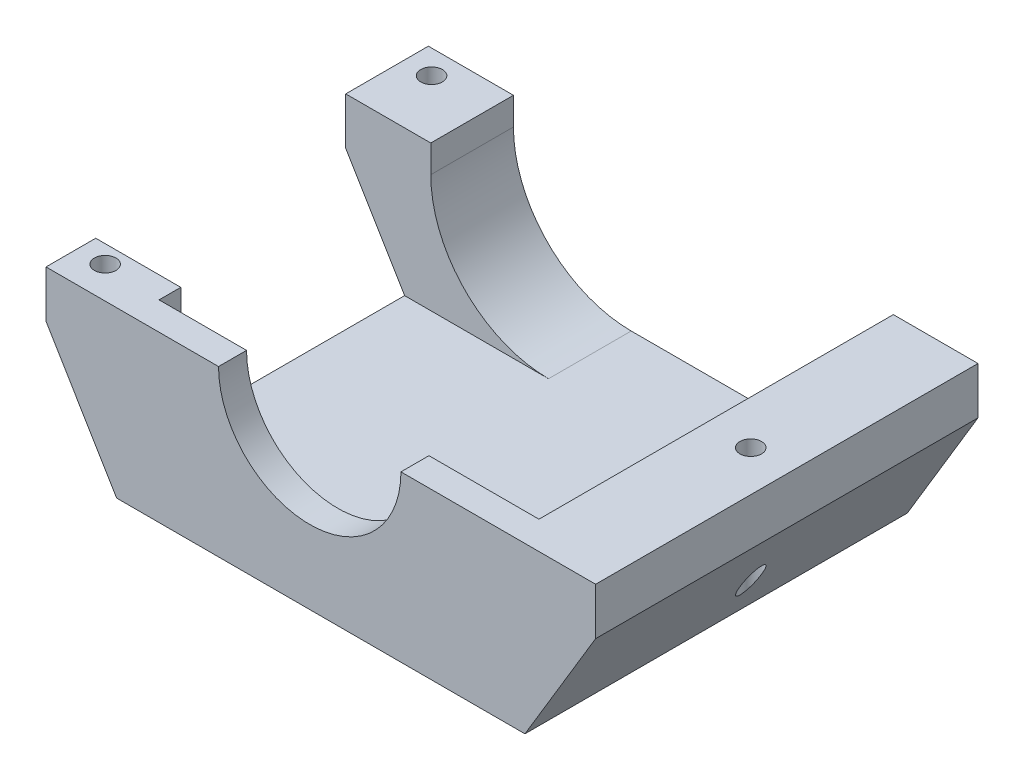
ISO-10303-21;
HEADER;
FILE_DESCRIPTION(('STEP AP214'),'2;1');
FILE_NAME('part.step','',(''),(''),'','','');
FILE_SCHEMA(('AUTOMOTIVE_DESIGN { 1 0 10303 214 1 1 1 1 }'));
ENDSEC;
DATA;
#1=APPLICATION_CONTEXT('core data for automotive mechanical design processes');
#2=APPLICATION_PROTOCOL_DEFINITION('international standard','automotive_design',2000,#1);
#3=PRODUCT_CONTEXT('',#1,'mechanical');
#4=PRODUCT('Part','Part','',(#3));
#5=PRODUCT_RELATED_PRODUCT_CATEGORY('part','',(#4));
#6=PRODUCT_DEFINITION_FORMATION('','',#4);
#7=PRODUCT_DEFINITION_CONTEXT('part definition',#1,'design');
#8=PRODUCT_DEFINITION('design','',#6,#7);
#9=PRODUCT_DEFINITION_SHAPE('','',#8);
#10=(LENGTH_UNIT() NAMED_UNIT(*) SI_UNIT(.MILLI.,.METRE.));
#11=(NAMED_UNIT(*) PLANE_ANGLE_UNIT() SI_UNIT($,.RADIAN.));
#12=(NAMED_UNIT(*) SI_UNIT($,.STERADIAN.) SOLID_ANGLE_UNIT());
#13=UNCERTAINTY_MEASURE_WITH_UNIT(LENGTH_MEASURE(1.E-05),#10,'distance_accuracy_value','');
#14=(GEOMETRIC_REPRESENTATION_CONTEXT(3) GLOBAL_UNCERTAINTY_ASSIGNED_CONTEXT((#13)) GLOBAL_UNIT_ASSIGNED_CONTEXT((#10,
#11,#12)) REPRESENTATION_CONTEXT('',''));
#15=CARTESIAN_POINT('',(0.,0.,0.));
#16=DIRECTION('',(0.,0.,1.));
#17=DIRECTION('',(1.,0.,0.));
#18=AXIS2_PLACEMENT_3D('',#15,#16,#17);
#19=CARTESIAN_POINT('',(88.4243474547859,33.,-97.3933423163109));
#20=DIRECTION('',(0.,0.,1.));
#21=DIRECTION('',(1.,0.,0.));
#22=AXIS2_PLACEMENT_3D('',#19,#20,#21);
#23=CYLINDRICAL_SURFACE('',#22,30.);
#24=DIRECTION('',(0.,0.,1.));
#25=VECTOR('',#24,1.);
#26=CARTESIAN_POINT('',(118.424347454786,33.,-97.3933423163109));
#27=LINE('',#26,#25);
#28=CARTESIAN_POINT('',(118.424347454786,33.,-97.3933423163109));
#29=VERTEX_POINT('',#28);
#30=CARTESIAN_POINT('',(118.424347454786,33.,-7.13392697639392));
#31=VERTEX_POINT('',#30);
#32=EDGE_CURVE('E266',#29,#31,#27,.T.);
#33=ORIENTED_EDGE('',*,*,#32,.F.);
#34=CARTESIAN_POINT('',(88.4243474547859,33.,-97.3933423163109));
#35=DIRECTION('',(0.,0.,-1.));
#36=DIRECTION('',(-1.,0.,0.));
#37=AXIS2_PLACEMENT_3D('',#34,#35,#36);
#38=CIRCLE('',#37,30.);
#39=CARTESIAN_POINT('',(88.4243474547859,3.,-97.3933423163109));
#40=VERTEX_POINT('',#39);
#41=EDGE_CURVE('E11',#29,#40,#38,.T.);
#42=ORIENTED_EDGE('',*,*,#41,.T.);
#43=DIRECTION('',(0.,0.,1.));
#44=VECTOR('',#43,1.);
#45=CARTESIAN_POINT('',(88.4243474547859,3.,0.));
#46=LINE('',#45,#44);
#47=CARTESIAN_POINT('',(88.4243474547859,3.,-7.13392697639392));
#48=VERTEX_POINT('',#47);
#49=EDGE_CURVE('E269',#48,#40,#46,.F.);
#50=ORIENTED_EDGE('',*,*,#49,.F.);
#51=CARTESIAN_POINT('',(88.4243474547859,33.,-7.13392697639392));
#52=DIRECTION('',(0.,0.,1.));
#53=DIRECTION('',(1.,0.,0.));
#54=AXIS2_PLACEMENT_3D('',#51,#52,#53);
#55=CIRCLE('',#54,30.);
#56=EDGE_CURVE('E41',#31,#48,#55,.F.);
#57=ORIENTED_EDGE('',*,*,#56,.F.);
#58=EDGE_LOOP('',(#33,#42,#50,#57));
#59=FACE_BOUND('',#58,.T.);
#60=ADVANCED_FACE('F34',(#59),#23,.F.);
#61=CARTESIAN_POINT('',(51.6644031130144,33.,-97.3933423163109));
#62=DIRECTION('',(0.,0.,-1.));
#63=DIRECTION('',(-1.,0.,0.));
#64=AXIS2_PLACEMENT_3D('',#61,#62,#63);
#65=CYLINDRICAL_SURFACE('',#64,30.);
#66=DIRECTION('',(0.,0.,-1.));
#67=VECTOR('',#66,1.);
#68=CARTESIAN_POINT('',(21.6644031130144,33.,-97.3933423163109));
#69=LINE('',#68,#67);
#70=CARTESIAN_POINT('',(21.6644031130144,33.,-76.3394750395605));
#71=VERTEX_POINT('',#70);
#72=CARTESIAN_POINT('',(21.6644031130144,33.,-97.3933423163109));
#73=VERTEX_POINT('',#72);
#74=EDGE_CURVE('E247',#71,#73,#69,.T.);
#75=ORIENTED_EDGE('',*,*,#74,.F.);
#76=CARTESIAN_POINT('',(51.6644031130144,33.,-76.3394750395605));
#77=DIRECTION('',(0.,0.,-1.));
#78=DIRECTION('',(-1.,0.,0.));
#79=AXIS2_PLACEMENT_3D('',#76,#77,#78);
#80=CIRCLE('',#79,30.);
#81=CARTESIAN_POINT('',(51.6644031130144,3.,-76.3394750395605));
#82=VERTEX_POINT('',#81);
#83=EDGE_CURVE('E167',#71,#82,#80,.F.);
#84=ORIENTED_EDGE('',*,*,#83,.T.);
#85=DIRECTION('',(0.,0.,-1.));
#86=VECTOR('',#85,1.);
#87=CARTESIAN_POINT('',(51.6644031130144,3.,0.));
#88=LINE('',#87,#86);
#89=CARTESIAN_POINT('',(51.6644031130144,3.,-97.3933423163109));
#90=VERTEX_POINT('',#89);
#91=EDGE_CURVE('E260',#90,#82,#88,.F.);
#92=ORIENTED_EDGE('',*,*,#91,.F.);
#93=CARTESIAN_POINT('',(51.6644031130144,33.,-97.3933423163109));
#94=DIRECTION('',(0.,0.,-1.));
#95=DIRECTION('',(-1.,0.,0.));
#96=AXIS2_PLACEMENT_3D('',#93,#94,#95);
#97=CIRCLE('',#96,30.);
#98=EDGE_CURVE('E264',#90,#73,#97,.T.);
#99=ORIENTED_EDGE('',*,*,#98,.T.);
#100=EDGE_LOOP('',(#75,#84,#92,#99));
#101=FACE_BOUND('',#100,.T.);
#102=ADVANCED_FACE('F347',(#101),#65,.F.);
#103=CARTESIAN_POINT('',(0.,-2.,0.));
#104=DIRECTION('',(-1.,0.,0.));
#105=DIRECTION('',(0.,0.,1.));
#106=AXIS2_PLACEMENT_3D('',#103,#104,#105);
#107=PLANE('',#106);
#108=DIRECTION('',(0.,-1.,0.));
#109=VECTOR('',#108,1.);
#110=CARTESIAN_POINT('',(0.,-2.,-76.3394750395605));
#111=LINE('',#110,#109);
#112=CARTESIAN_POINT('',(0.,40.,-76.3394750395605));
#113=VERTEX_POINT('',#112);
#114=CARTESIAN_POINT('',(0.,28.,-76.3394750395605));
#115=VERTEX_POINT('',#114);
#116=EDGE_CURVE('E315',#113,#115,#111,.T.);
#117=ORIENTED_EDGE('',*,*,#116,.F.);
#118=DIRECTION('',(0.,0.,1.));
#119=VECTOR('',#118,1.);
#120=CARTESIAN_POINT('',(0.,40.,0.));
#121=LINE('',#120,#119);
#122=CARTESIAN_POINT('',(0.,40.,-97.3933423163109));
#123=VERTEX_POINT('',#122);
#124=EDGE_CURVE('E183',#123,#113,#121,.T.);
#125=ORIENTED_EDGE('',*,*,#124,.F.);
#126=DIRECTION('',(0.,1.,0.));
#127=VECTOR('',#126,1.);
#128=CARTESIAN_POINT('',(0.,-2.,-97.3933423163109));
#129=LINE('',#128,#127);
#130=CARTESIAN_POINT('',(0.,28.,-97.3933423163109));
#131=VERTEX_POINT('',#130);
#132=EDGE_CURVE('E232',#131,#123,#129,.T.);
#133=ORIENTED_EDGE('',*,*,#132,.F.);
#134=DIRECTION('',(0.,0.,-1.));
#135=VECTOR('',#134,1.);
#136=CARTESIAN_POINT('',(0.,28.,-97.3933423163109));
#137=LINE('',#136,#135);
#138=EDGE_CURVE('E300',#115,#131,#137,.T.);
#139=ORIENTED_EDGE('',*,*,#138,.F.);
#140=EDGE_LOOP('',(#117,#125,#133,#139));
#141=FACE_BOUND('',#140,.T.);
#142=ADVANCED_FACE('F336',(#141),#107,.T.);
#143=CARTESIAN_POINT('',(0.,40.,0.));
#144=DIRECTION('',(0.,-1.,0.));
#145=DIRECTION('',(0.,0.,-1.));
#146=AXIS2_PLACEMENT_3D('',#143,#144,#145);
#147=PLANE('',#146);
#148=CARTESIAN_POINT('',(6.93445288931982,40.,-91.2755933321376));
#149=DIRECTION('',(0.,1.,0.));
#150=DIRECTION('',(0.,0.,1.));
#151=AXIS2_PLACEMENT_3D('',#148,#149,#150);
#152=CIRCLE('',#151,2.75);
#153=CARTESIAN_POINT('',(6.93445288931982,40.,-88.5255933321376));
#154=VERTEX_POINT('',#153);
#155=EDGE_CURVE('E258',#154,#154,#152,.T.);
#156=ORIENTED_EDGE('',*,*,#155,.F.);
#157=EDGE_LOOP('',(#156));
#158=FACE_BOUND('',#157,.T.);
#159=ORIENTED_EDGE('',*,*,#124,.T.);
#160=DIRECTION('',(1.,0.,0.));
#161=VECTOR('',#160,1.);
#162=CARTESIAN_POINT('',(-8.33559688698558,40.,-76.3394750395605));
#163=LINE('',#162,#161);
#164=CARTESIAN_POINT('',(21.6644031130144,40.,-76.3394750395605));
#165=VERTEX_POINT('',#164);
#166=EDGE_CURVE('E164',#113,#165,#163,.T.);
#167=ORIENTED_EDGE('',*,*,#166,.T.);
#168=DIRECTION('',(0.,0.,1.));
#169=VECTOR('',#168,1.);
#170=CARTESIAN_POINT('',(21.6644031130144,40.,-97.3933423163109));
#171=LINE('',#170,#169);
#172=CARTESIAN_POINT('',(21.6644031130144,40.,-97.3933423163109));
#173=VERTEX_POINT('',#172);
#174=EDGE_CURVE('E180',#173,#165,#171,.T.);
#175=ORIENTED_EDGE('',*,*,#174,.F.);
#176=DIRECTION('',(-1.,0.,0.));
#177=VECTOR('',#176,1.);
#178=CARTESIAN_POINT('',(0.,40.,-97.3933423163109));
#179=LINE('',#178,#177);
#180=EDGE_CURVE('E222',#173,#123,#179,.T.);
#181=ORIENTED_EDGE('',*,*,#180,.T.);
#182=EDGE_LOOP('',(#159,#167,#175,#181));
#183=FACE_BOUND('',#182,.T.);
#184=ADVANCED_FACE('F178',(#158,#183),#147,.F.);
#185=CARTESIAN_POINT('',(21.6644031130144,3.,-97.3933423163109));
#186=DIRECTION('',(-1.,0.,0.));
#187=DIRECTION('',(0.,0.,1.));
#188=AXIS2_PLACEMENT_3D('',#185,#186,#187);
#189=PLANE('',#188);
#190=DIRECTION('',(0.,1.,0.));
#191=VECTOR('',#190,1.);
#192=CARTESIAN_POINT('',(21.6644031130144,3.,-76.3394750395605));
#193=LINE('',#192,#191);
#194=EDGE_CURVE('E161',#71,#165,#193,.T.);
#195=ORIENTED_EDGE('',*,*,#194,.F.);
#196=ORIENTED_EDGE('',*,*,#74,.T.);
#197=DIRECTION('',(0.,1.,0.));
#198=VECTOR('',#197,1.);
#199=CARTESIAN_POINT('',(21.6644031130144,3.,-97.3933423163109));
#200=LINE('',#199,#198);
#201=EDGE_CURVE('E188',#73,#173,#200,.T.);
#202=ORIENTED_EDGE('',*,*,#201,.T.);
#203=ORIENTED_EDGE('',*,*,#174,.T.);
#204=EDGE_LOOP('',(#195,#196,#202,#203));
#205=FACE_BOUND('',#204,.T.);
#206=ADVANCED_FACE('F186',(#205),#189,.F.);
#207=CARTESIAN_POINT('',(129.624485254823,40.,-49.8785981742458));
#208=DIRECTION('',(0.,1.,0.));
#209=DIRECTION('',(0.,0.,1.));
#210=AXIS2_PLACEMENT_3D('',#207,#208,#209);
#211=CIRCLE('',#210,2.75000000000001);
#212=CARTESIAN_POINT('',(129.624485254823,40.,-47.1285981742458));
#213=VERTEX_POINT('',#212);
#214=EDGE_CURVE('E250',#213,#213,#211,.T.);
#215=ORIENTED_EDGE('',*,*,#214,.F.);
#216=EDGE_LOOP('',(#215));
#217=FACE_BOUND('',#216,.T.);
#218=DIRECTION('',(1.,0.,0.));
#219=VECTOR('',#218,1.);
#220=CARTESIAN_POINT('',(21.6644031130144,40.,-7.13392697639392));
#221=LINE('',#220,#219);
#222=CARTESIAN_POINT('',(90.4058082347499,40.,-7.13392697639392));
#223=VERTEX_POINT('',#222);
#224=CARTESIAN_POINT('',(118.424347454786,40.,-7.13392697639392));
#225=VERTEX_POINT('',#224);
#226=EDGE_CURVE('E189',#223,#225,#221,.T.);
#227=ORIENTED_EDGE('',*,*,#226,.F.);
#228=DIRECTION('',(0.,0.,1.));
#229=VECTOR('',#228,1.);
#230=CARTESIAN_POINT('',(90.4058082347499,40.,-72.83989263353));
#231=LINE('',#230,#229);
#232=CARTESIAN_POINT('',(90.4058082347499,40.,0.));
#233=VERTEX_POINT('',#232);
#234=EDGE_CURVE('E195',#223,#233,#231,.T.);
#235=ORIENTED_EDGE('',*,*,#234,.T.);
#236=DIRECTION('',(1.,0.,0.));
#237=VECTOR('',#236,1.);
#238=CARTESIAN_POINT('',(0.,40.,0.));
#239=LINE('',#238,#237);
#240=CARTESIAN_POINT('',(139.991389113124,40.,0.));
#241=VERTEX_POINT('',#240);
#242=EDGE_CURVE('E215',#233,#241,#239,.T.);
#243=ORIENTED_EDGE('',*,*,#242,.T.);
#244=DIRECTION('',(0.,0.,-1.));
#245=VECTOR('',#244,1.);
#246=CARTESIAN_POINT('',(139.991389113124,40.,0.));
#247=LINE('',#246,#245);
#248=CARTESIAN_POINT('',(139.991389113124,40.,-97.3933423163109));
#249=VERTEX_POINT('',#248);
#250=EDGE_CURVE('E219',#241,#249,#247,.T.);
#251=ORIENTED_EDGE('',*,*,#250,.T.);
#252=CARTESIAN_POINT('',(118.424347454786,40.,-97.3933423163109));
#253=VERTEX_POINT('',#252);
#254=EDGE_CURVE('E223',#249,#253,#179,.T.);
#255=ORIENTED_EDGE('',*,*,#254,.T.);
#256=DIRECTION('',(0.,0.,-1.));
#257=VECTOR('',#256,1.);
#258=CARTESIAN_POINT('',(118.424347454786,40.,-97.3933423163109));
#259=LINE('',#258,#257);
#260=EDGE_CURVE('E201',#225,#253,#259,.T.);
#261=ORIENTED_EDGE('',*,*,#260,.F.);
#262=EDGE_LOOP('',(#227,#235,#243,#251,#255,#261));
#263=FACE_BOUND('',#262,.T.);
#264=ADVANCED_FACE('F338',(#217,#263),#147,.F.);
#265=DIRECTION('',(0.,1.,0.));
#266=VECTOR('',#265,1.);
#267=CARTESIAN_POINT('',(0.,-2.,-12.6665994272912));
#268=LINE('',#267,#266);
#269=CARTESIAN_POINT('',(0.,28.,-12.6665994272912));
#270=VERTEX_POINT('',#269);
#271=CARTESIAN_POINT('',(0.,40.,-12.6665994272912));
#272=VERTEX_POINT('',#271);
#273=EDGE_CURVE('E317',#270,#272,#268,.T.);
#274=ORIENTED_EDGE('',*,*,#273,.F.);
#275=CARTESIAN_POINT('',(0.,28.,0.));
#276=VERTEX_POINT('',#275);
#277=EDGE_CURVE('E294',#276,#270,#137,.T.);
#278=ORIENTED_EDGE('',*,*,#277,.F.);
#279=DIRECTION('',(0.,1.,0.));
#280=VECTOR('',#279,1.);
#281=CARTESIAN_POINT('',(0.,-2.,0.));
#282=LINE('',#281,#280);
#283=CARTESIAN_POINT('',(0.,40.,0.));
#284=VERTEX_POINT('',#283);
#285=EDGE_CURVE('E231',#276,#284,#282,.T.);
#286=ORIENTED_EDGE('',*,*,#285,.T.);
#287=EDGE_CURVE('E206',#272,#284,#121,.T.);
#288=ORIENTED_EDGE('',*,*,#287,.F.);
#289=EDGE_LOOP('',(#274,#278,#286,#288));
#290=FACE_BOUND('',#289,.T.);
#291=ADVANCED_FACE('F350',(#290),#107,.T.);
#292=CARTESIAN_POINT('',(0.,-2.,-97.3933423163109));
#293=DIRECTION('',(0.,0.,-1.));
#294=DIRECTION('',(-1.,0.,0.));
#295=AXIS2_PLACEMENT_3D('',#292,#293,#294);
#296=PLANE('',#295);
#297=ORIENTED_EDGE('',*,*,#41,.F.);
#298=DIRECTION('',(0.,1.,0.));
#299=VECTOR('',#298,1.);
#300=CARTESIAN_POINT('',(118.424347454786,3.,-97.3933423163109));
#301=LINE('',#300,#299);
#302=EDGE_CURVE('E207',#29,#253,#301,.T.);
#303=ORIENTED_EDGE('',*,*,#302,.T.);
#304=ORIENTED_EDGE('',*,*,#254,.F.);
#305=DIRECTION('',(0.,1.,0.));
#306=VECTOR('',#305,1.);
#307=CARTESIAN_POINT('',(139.991389113124,-2.,-97.3933423163109));
#308=LINE('',#307,#306);
#309=CARTESIAN_POINT('',(139.991389113124,28.,-97.3933423163109));
#310=VERTEX_POINT('',#309);
#311=EDGE_CURVE('E235',#310,#249,#308,.T.);
#312=ORIENTED_EDGE('',*,*,#311,.F.);
#313=DIRECTION('',(0.514495755427527,0.857492925712544,0.));
#314=VECTOR('',#313,1.);
#315=CARTESIAN_POINT('',(121.991389113124,-2.,-97.3933423163109));
#316=LINE('',#315,#314);
#317=CARTESIAN_POINT('',(121.991389113124,-2.,-97.3933423163109));
#318=VERTEX_POINT('',#317);
#319=EDGE_CURVE('E309',#318,#310,#316,.T.);
#320=ORIENTED_EDGE('',*,*,#319,.F.);
#321=DIRECTION('',(-1.,0.,0.));
#322=VECTOR('',#321,1.);
#323=CARTESIAN_POINT('',(0.,-2.,-97.3933423163109));
#324=LINE('',#323,#322);
#325=CARTESIAN_POINT('',(18.,-2.,-97.3933423163109));
#326=VERTEX_POINT('',#325);
#327=EDGE_CURVE('E228',#318,#326,#324,.T.);
#328=ORIENTED_EDGE('',*,*,#327,.T.);
#329=DIRECTION('',(0.514495755427527,-0.857492925712544,0.));
#330=VECTOR('',#329,1.);
#331=CARTESIAN_POINT('',(18.,-2.,-97.3933423163109));
#332=LINE('',#331,#330);
#333=EDGE_CURVE('E301',#131,#326,#332,.T.);
#334=ORIENTED_EDGE('',*,*,#333,.F.);
#335=ORIENTED_EDGE('',*,*,#132,.T.);
#336=ORIENTED_EDGE('',*,*,#180,.F.);
#337=ORIENTED_EDGE('',*,*,#201,.F.);
#338=ORIENTED_EDGE('',*,*,#98,.F.);
#339=DIRECTION('',(-1.,0.,0.));
#340=VECTOR('',#339,1.);
#341=CARTESIAN_POINT('',(21.6644031130144,3.,-97.3933423163109));
#342=LINE('',#341,#340);
#343=EDGE_CURVE('E197',#40,#90,#342,.T.);
#344=ORIENTED_EDGE('',*,*,#343,.F.);
#345=EDGE_LOOP('',(#297,#303,#304,#312,#320,#328,#334,#335,#336,#337,#338,#344));
#346=FACE_BOUND('',#345,.T.);
#347=ADVANCED_FACE('F277',(#346),#296,.T.);
#348=CARTESIAN_POINT('',(139.991389113124,-2.,0.));
#349=DIRECTION('',(1.,0.,0.));
#350=DIRECTION('',(0.,0.,-1.));
#351=AXIS2_PLACEMENT_3D('',#348,#349,#350);
#352=PLANE('',#351);
#353=DIRECTION('',(0.,0.,1.));
#354=VECTOR('',#353,1.);
#355=CARTESIAN_POINT('',(139.991389113124,28.,0.));
#356=LINE('',#355,#354);
#357=CARTESIAN_POINT('',(139.991389113124,28.,0.));
#358=VERTEX_POINT('',#357);
#359=EDGE_CURVE('E290',#310,#358,#356,.T.);
#360=ORIENTED_EDGE('',*,*,#359,.F.);
#361=ORIENTED_EDGE('',*,*,#311,.T.);
#362=ORIENTED_EDGE('',*,*,#250,.F.);
#363=DIRECTION('',(0.,1.,0.));
#364=VECTOR('',#363,1.);
#365=CARTESIAN_POINT('',(139.991389113124,-2.,0.));
#366=LINE('',#365,#364);
#367=EDGE_CURVE('E237',#358,#241,#366,.T.);
#368=ORIENTED_EDGE('',*,*,#367,.F.);
#369=EDGE_LOOP('',(#360,#361,#362,#368));
#370=FACE_BOUND('',#369,.T.);
#371=ADVANCED_FACE('F376',(#370),#352,.T.);
#372=CARTESIAN_POINT('',(0.,-2.,0.));
#373=DIRECTION('',(0.,0.,1.));
#374=DIRECTION('',(1.,0.,0.));
#375=AXIS2_PLACEMENT_3D('',#372,#373,#374);
#376=PLANE('',#375);
#377=DIRECTION('',(1.,0.,0.));
#378=VECTOR('',#377,1.);
#379=CARTESIAN_POINT('',(0.,-2.,0.));
#380=LINE('',#379,#378);
#381=CARTESIAN_POINT('',(18.,-2.,0.));
#382=VERTEX_POINT('',#381);
#383=CARTESIAN_POINT('',(121.991389113124,-2.,0.));
#384=VERTEX_POINT('',#383);
#385=EDGE_CURVE('E226',#382,#384,#380,.T.);
#386=ORIENTED_EDGE('',*,*,#385,.T.);
#387=DIRECTION('',(0.514495755427527,0.857492925712544,0.));
#388=VECTOR('',#387,1.);
#389=CARTESIAN_POINT('',(121.991389113124,-2.,0.));
#390=LINE('',#389,#388);
#391=EDGE_CURVE('E312',#384,#358,#390,.T.);
#392=ORIENTED_EDGE('',*,*,#391,.T.);
#393=ORIENTED_EDGE('',*,*,#367,.T.);
#394=ORIENTED_EDGE('',*,*,#242,.F.);
#395=CARTESIAN_POINT('',(67.1752412944642,40.,0.));
#396=DIRECTION('',(0.,0.,1.));
#397=DIRECTION('',(1.,0.,0.));
#398=AXIS2_PLACEMENT_3D('',#395,#396,#397);
#399=CIRCLE('',#398,23.2305669402857);
#400=CARTESIAN_POINT('',(43.9446743541785,40.,0.));
#401=VERTEX_POINT('',#400);
#402=EDGE_CURVE('E288',#401,#233,#399,.T.);
#403=ORIENTED_EDGE('',*,*,#402,.F.);
#404=EDGE_CURVE('E216',#284,#401,#239,.T.);
#405=ORIENTED_EDGE('',*,*,#404,.F.);
#406=ORIENTED_EDGE('',*,*,#285,.F.);
#407=DIRECTION('',(0.514495755427526,-0.857492925712544,0.));
#408=VECTOR('',#407,1.);
#409=CARTESIAN_POINT('',(18.,-2.,0.));
#410=LINE('',#409,#408);
#411=EDGE_CURVE('E306',#276,#382,#410,.T.);
#412=ORIENTED_EDGE('',*,*,#411,.T.);
#413=EDGE_LOOP('',(#386,#392,#393,#394,#403,#405,#406,#412));
#414=FACE_BOUND('',#413,.T.);
#415=ADVANCED_FACE('F381',(#414),#376,.T.);
#416=CARTESIAN_POINT('',(0.,-2.,0.));
#417=DIRECTION('',(0.,-1.,0.));
#418=DIRECTION('',(0.,0.,-1.));
#419=AXIS2_PLACEMENT_3D('',#416,#417,#418);
#420=PLANE('',#419);
#421=DIRECTION('',(0.,0.,1.));
#422=VECTOR('',#421,1.);
#423=CARTESIAN_POINT('',(18.,-2.,-97.3933423163109));
#424=LINE('',#423,#422);
#425=EDGE_CURVE('E297',#326,#382,#424,.T.);
#426=ORIENTED_EDGE('',*,*,#425,.F.);
#427=ORIENTED_EDGE('',*,*,#327,.F.);
#428=DIRECTION('',(0.,0.,-1.));
#429=VECTOR('',#428,1.);
#430=CARTESIAN_POINT('',(121.991389113124,-2.,0.));
#431=LINE('',#430,#429);
#432=EDGE_CURVE('E291',#384,#318,#431,.T.);
#433=ORIENTED_EDGE('',*,*,#432,.F.);
#434=ORIENTED_EDGE('',*,*,#385,.F.);
#435=EDGE_LOOP('',(#426,#427,#433,#434));
#436=FACE_BOUND('',#435,.T.);
#437=ADVANCED_FACE('F355',(#436),#420,.T.);
#438=CARTESIAN_POINT('',(6.93445288931982,40.,-8.12889245211412));
#439=DIRECTION('',(0.,1.,0.));
#440=DIRECTION('',(0.,0.,1.));
#441=AXIS2_PLACEMENT_3D('',#438,#439,#440);
#442=CIRCLE('',#441,2.75);
#443=CARTESIAN_POINT('',(6.93445288931982,40.,-5.37889245211412));
#444=VERTEX_POINT('',#443);
#445=EDGE_CURVE('E254',#444,#444,#442,.T.);
#446=ORIENTED_EDGE('',*,*,#445,.F.);
#447=EDGE_LOOP('',(#446));
#448=FACE_BOUND('',#447,.T.);
#449=CARTESIAN_POINT('',(21.6644031130144,40.,-12.6665994272912));
#450=VERTEX_POINT('',#449);
#451=CARTESIAN_POINT('',(21.6644031130144,40.,-7.13392697639392));
#452=VERTEX_POINT('',#451);
#453=EDGE_CURVE('E190',#450,#452,#171,.T.);
#454=ORIENTED_EDGE('',*,*,#453,.F.);
#455=DIRECTION('',(1.,0.,0.));
#456=VECTOR('',#455,1.);
#457=CARTESIAN_POINT('',(-8.33559688698557,40.,-12.6665994272912));
#458=LINE('',#457,#456);
#459=EDGE_CURVE('E184',#272,#450,#458,.T.);
#460=ORIENTED_EDGE('',*,*,#459,.F.);
#461=ORIENTED_EDGE('',*,*,#287,.T.);
#462=ORIENTED_EDGE('',*,*,#404,.T.);
#463=DIRECTION('',(0.,0.,1.));
#464=VECTOR('',#463,1.);
#465=CARTESIAN_POINT('',(43.9446743541785,40.,-72.83989263353));
#466=LINE('',#465,#464);
#467=CARTESIAN_POINT('',(43.9446743541785,40.,-7.13392697639392));
#468=VERTEX_POINT('',#467);
#469=EDGE_CURVE('E283',#401,#468,#466,.F.);
#470=ORIENTED_EDGE('',*,*,#469,.T.);
#471=EDGE_CURVE('E193',#452,#468,#221,.T.);
#472=ORIENTED_EDGE('',*,*,#471,.F.);
#473=EDGE_LOOP('',(#454,#460,#461,#462,#470,#472));
#474=FACE_BOUND('',#473,.T.);
#475=ADVANCED_FACE('F339',(#448,#474),#147,.F.);
#476=DIRECTION('',(0.,0.,1.));
#477=VECTOR('',#476,1.);
#478=CARTESIAN_POINT('',(21.6644031130144,3.,-97.3933423163109));
#479=LINE('',#478,#477);
#480=CARTESIAN_POINT('',(21.6644031130144,3.,-12.6665994272912));
#481=VERTEX_POINT('',#480);
#482=CARTESIAN_POINT('',(21.6644031130144,3.,-7.13392697639392));
#483=VERTEX_POINT('',#482);
#484=EDGE_CURVE('E204',#481,#483,#479,.T.);
#485=ORIENTED_EDGE('',*,*,#484,.F.);
#486=DIRECTION('',(0.,-1.,0.));
#487=VECTOR('',#486,1.);
#488=CARTESIAN_POINT('',(21.6644031130144,3.,-12.6665994272912));
#489=LINE('',#488,#487);
#490=EDGE_CURVE('E172',#450,#481,#489,.T.);
#491=ORIENTED_EDGE('',*,*,#490,.F.);
#492=ORIENTED_EDGE('',*,*,#453,.T.);
#493=DIRECTION('',(0.,1.,0.));
#494=VECTOR('',#493,1.);
#495=CARTESIAN_POINT('',(21.6644031130144,3.,-7.13392697639392));
#496=LINE('',#495,#494);
#497=EDGE_CURVE('E211',#483,#452,#496,.T.);
#498=ORIENTED_EDGE('',*,*,#497,.F.);
#499=EDGE_LOOP('',(#485,#491,#492,#498));
#500=FACE_BOUND('',#499,.T.);
#501=ADVANCED_FACE('F346',(#500),#189,.F.);
#502=CARTESIAN_POINT('',(118.424347454786,3.,-97.3933423163109));
#503=DIRECTION('',(1.,0.,0.));
#504=DIRECTION('',(0.,0.,-1.));
#505=AXIS2_PLACEMENT_3D('',#502,#503,#504);
#506=PLANE('',#505);
#507=ORIENTED_EDGE('',*,*,#302,.F.);
#508=ORIENTED_EDGE('',*,*,#32,.T.);
#509=DIRECTION('',(0.,1.,0.));
#510=VECTOR('',#509,1.);
#511=CARTESIAN_POINT('',(118.424347454786,3.,-7.13392697639392));
#512=LINE('',#511,#510);
#513=EDGE_CURVE('E209',#31,#225,#512,.T.);
#514=ORIENTED_EDGE('',*,*,#513,.T.);
#515=ORIENTED_EDGE('',*,*,#260,.T.);
#516=EDGE_LOOP('',(#507,#508,#514,#515));
#517=FACE_BOUND('',#516,.T.);
#518=ADVANCED_FACE('F365',(#517),#506,.F.);
#519=CARTESIAN_POINT('',(21.6644031130144,3.,-7.13392697639392));
#520=DIRECTION('',(0.,0.,1.));
#521=DIRECTION('',(1.,0.,0.));
#522=AXIS2_PLACEMENT_3D('',#519,#520,#521);
#523=PLANE('',#522);
#524=ORIENTED_EDGE('',*,*,#513,.F.);
#525=ORIENTED_EDGE('',*,*,#56,.T.);
#526=DIRECTION('',(1.,0.,0.));
#527=VECTOR('',#526,1.);
#528=CARTESIAN_POINT('',(21.6644031130144,3.,-7.13392697639392));
#529=LINE('',#528,#527);
#530=EDGE_CURVE('E275',#483,#48,#529,.T.);
#531=ORIENTED_EDGE('',*,*,#530,.F.);
#532=ORIENTED_EDGE('',*,*,#497,.T.);
#533=ORIENTED_EDGE('',*,*,#471,.T.);
#534=CARTESIAN_POINT('',(67.1752412944642,40.,-7.13392697639392));
#535=DIRECTION('',(0.,0.,1.));
#536=DIRECTION('',(1.,0.,0.));
#537=AXIS2_PLACEMENT_3D('',#534,#535,#536);
#538=CIRCLE('',#537,23.2305669402857);
#539=EDGE_CURVE('E286',#223,#468,#538,.F.);
#540=ORIENTED_EDGE('',*,*,#539,.F.);
#541=ORIENTED_EDGE('',*,*,#226,.T.);
#542=EDGE_LOOP('',(#524,#525,#531,#532,#533,#540,#541));
#543=FACE_BOUND('',#542,.T.);
#544=ADVANCED_FACE('F409',(#543),#523,.F.);
#545=CARTESIAN_POINT('',(0.,3.,0.));
#546=DIRECTION('',(0.,1.,0.));
#547=DIRECTION('',(0.,0.,1.));
#548=AXIS2_PLACEMENT_3D('',#545,#546,#547);
#549=PLANE('',#548);
#550=ORIENTED_EDGE('',*,*,#530,.T.);
#551=ORIENTED_EDGE('',*,*,#49,.T.);
#552=ORIENTED_EDGE('',*,*,#343,.T.);
#553=ORIENTED_EDGE('',*,*,#91,.T.);
#554=DIRECTION('',(1.,0.,0.));
#555=VECTOR('',#554,1.);
#556=CARTESIAN_POINT('',(-8.33559688698558,3.,-76.3394750395605));
#557=LINE('',#556,#555);
#558=CARTESIAN_POINT('',(15.,3.,-76.3394750395605));
#559=VERTEX_POINT('',#558);
#560=EDGE_CURVE('E318',#559,#82,#557,.T.);
#561=ORIENTED_EDGE('',*,*,#560,.F.);
#562=DIRECTION('',(0.,0.,1.));
#563=VECTOR('',#562,1.);
#564=CARTESIAN_POINT('',(15.,3.,-132.379053685383));
#565=LINE('',#564,#563);
#566=CARTESIAN_POINT('',(15.,3.,-12.6665994272912));
#567=VERTEX_POINT('',#566);
#568=EDGE_CURVE('E242',#559,#567,#565,.T.);
#569=ORIENTED_EDGE('',*,*,#568,.T.);
#570=DIRECTION('',(1.,0.,0.));
#571=VECTOR('',#570,1.);
#572=CARTESIAN_POINT('',(-8.33559688698557,3.,-12.6665994272912));
#573=LINE('',#572,#571);
#574=EDGE_CURVE('E321',#567,#481,#573,.T.);
#575=ORIENTED_EDGE('',*,*,#574,.T.);
#576=ORIENTED_EDGE('',*,*,#484,.T.);
#577=EDGE_LOOP('',(#550,#551,#552,#553,#561,#569,#575,#576));
#578=FACE_BOUND('',#577,.T.);
#579=ADVANCED_FACE('F273',(#578),#549,.T.);
#580=CARTESIAN_POINT('',(67.1752412944642,40.,-72.83989263353));
#581=DIRECTION('',(0.,0.,1.));
#582=DIRECTION('',(1.,0.,0.));
#583=AXIS2_PLACEMENT_3D('',#580,#581,#582);
#584=CYLINDRICAL_SURFACE('',#583,23.2305669402857);
#585=ORIENTED_EDGE('',*,*,#539,.T.);
#586=ORIENTED_EDGE('',*,*,#469,.F.);
#587=ORIENTED_EDGE('',*,*,#402,.T.);
#588=ORIENTED_EDGE('',*,*,#234,.F.);
#589=EDGE_LOOP('',(#585,#586,#587,#588));
#590=FACE_BOUND('',#589,.T.);
#591=ADVANCED_FACE('F416',(#590),#584,.F.);
#592=CARTESIAN_POINT('',(18.,-2.,-132.379053685383));
#593=DIRECTION('',(-0.857492925712544,-0.514495755427526,0.));
#594=DIRECTION('',(0.514495755427527,-0.857492925712544,0.));
#595=AXIS2_PLACEMENT_3D('',#592,#593,#594);
#596=PLANE('',#595);
#597=CARTESIAN_POINT('',(6.93445288931982,16.4425785178003,-91.2755933321376));
#598=DIRECTION('',(-0.857492925712544,-0.514495755427526,0.));
#599=DIRECTION('',(-0.514495755427527,0.857492925712544,0.));
#600=AXIS2_PLACEMENT_3D('',#597,#598,#599);
#601=ELLIPSE('',#600,5.34503923694152,2.75);
#602=CARTESIAN_POINT('',(4.18445288931982,21.0259118511336,-91.2755933321376));
#603=VERTEX_POINT('',#602);
#604=EDGE_CURVE('E255',#603,#603,#601,.T.);
#605=ORIENTED_EDGE('',*,*,#604,.F.);
#606=EDGE_LOOP('',(#605));
#607=FACE_BOUND('',#606,.T.);
#608=CARTESIAN_POINT('',(6.93445288931982,16.4425785178003,-8.12889245211412));
#609=DIRECTION('',(-0.857492925712544,-0.514495755427526,0.));
#610=DIRECTION('',(-0.514495755427527,0.857492925712544,0.));
#611=AXIS2_PLACEMENT_3D('',#608,#609,#610);
#612=ELLIPSE('',#611,5.34503923694152,2.75);
#613=CARTESIAN_POINT('',(4.18445288931982,21.0259118511336,-8.12889245211412));
#614=VERTEX_POINT('',#613);
#615=EDGE_CURVE('E251',#614,#614,#612,.T.);
#616=ORIENTED_EDGE('',*,*,#615,.F.);
#617=EDGE_LOOP('',(#616));
#618=FACE_BOUND('',#617,.T.);
#619=DIRECTION('',(0.514495755427527,-0.857492925712544,0.));
#620=VECTOR('',#619,1.);
#621=CARTESIAN_POINT('',(18.,-2.,-76.3394750395605));
#622=LINE('',#621,#620);
#623=EDGE_CURVE('E245',#115,#559,#622,.T.);
#624=ORIENTED_EDGE('',*,*,#623,.F.);
#625=ORIENTED_EDGE('',*,*,#138,.T.);
#626=ORIENTED_EDGE('',*,*,#333,.T.);
#627=ORIENTED_EDGE('',*,*,#425,.T.);
#628=ORIENTED_EDGE('',*,*,#411,.F.);
#629=ORIENTED_EDGE('',*,*,#277,.T.);
#630=DIRECTION('',(-0.514495755427527,0.857492925712544,0.));
#631=VECTOR('',#630,1.);
#632=CARTESIAN_POINT('',(18.,-2.00000000000001,-12.6665994272912));
#633=LINE('',#632,#631);
#634=EDGE_CURVE('E234',#567,#270,#633,.T.);
#635=ORIENTED_EDGE('',*,*,#634,.F.);
#636=ORIENTED_EDGE('',*,*,#568,.F.);
#637=EDGE_LOOP('',(#624,#625,#626,#627,#628,#629,#635,#636));
#638=FACE_BOUND('',#637,.T.);
#639=ADVANCED_FACE('F389',(#607,#618,#638),#596,.T.);
#640=CARTESIAN_POINT('',(121.991389113124,-2.,-132.379053685383));
#641=DIRECTION('',(0.857492925712544,-0.514495755427527,0.));
#642=DIRECTION('',(0.514495755427527,0.857492925712544,0.));
#643=AXIS2_PLACEMENT_3D('',#640,#641,#642);
#644=PLANE('',#643);
#645=CARTESIAN_POINT('',(129.624485254823,10.721826902831,-49.8785981742458));
#646=DIRECTION('',(0.857492925712544,-0.514495755427527,0.));
#647=DIRECTION('',(0.514495755427527,0.857492925712544,0.));
#648=AXIS2_PLACEMENT_3D('',#645,#646,#647);
#649=ELLIPSE('',#648,5.34503923694154,2.75000000000001);
#650=CARTESIAN_POINT('',(132.374485254823,15.3051602361643,-49.8785981742458));
#651=VERTEX_POINT('',#650);
#652=EDGE_CURVE('E173',#651,#651,#649,.T.);
#653=ORIENTED_EDGE('',*,*,#652,.F.);
#654=EDGE_LOOP('',(#653));
#655=FACE_BOUND('',#654,.T.);
#656=ORIENTED_EDGE('',*,*,#432,.T.);
#657=ORIENTED_EDGE('',*,*,#319,.T.);
#658=ORIENTED_EDGE('',*,*,#359,.T.);
#659=ORIENTED_EDGE('',*,*,#391,.F.);
#660=EDGE_LOOP('',(#656,#657,#658,#659));
#661=FACE_BOUND('',#660,.T.);
#662=ADVANCED_FACE('F379',(#655,#661),#644,.T.);
#663=CARTESIAN_POINT('',(-8.33559688698558,3.,-76.3394750395605));
#664=DIRECTION('',(0.,0.,-1.));
#665=DIRECTION('',(-1.,0.,0.));
#666=AXIS2_PLACEMENT_3D('',#663,#664,#665);
#667=PLANE('',#666);
#668=ORIENTED_EDGE('',*,*,#116,.T.);
#669=ORIENTED_EDGE('',*,*,#623,.T.);
#670=ORIENTED_EDGE('',*,*,#560,.T.);
#671=ORIENTED_EDGE('',*,*,#83,.F.);
#672=ORIENTED_EDGE('',*,*,#194,.T.);
#673=ORIENTED_EDGE('',*,*,#166,.F.);
#674=EDGE_LOOP('',(#668,#669,#670,#671,#672,#673));
#675=FACE_BOUND('',#674,.T.);
#676=ADVANCED_FACE('F163',(#675),#667,.F.);
#677=CARTESIAN_POINT('',(-8.33559688698557,3.,-12.6665994272912));
#678=DIRECTION('',(0.,0.,1.));
#679=DIRECTION('',(1.,0.,0.));
#680=AXIS2_PLACEMENT_3D('',#677,#678,#679);
#681=PLANE('',#680);
#682=ORIENTED_EDGE('',*,*,#273,.T.);
#683=ORIENTED_EDGE('',*,*,#459,.T.);
#684=ORIENTED_EDGE('',*,*,#490,.T.);
#685=ORIENTED_EDGE('',*,*,#574,.F.);
#686=ORIENTED_EDGE('',*,*,#634,.T.);
#687=EDGE_LOOP('',(#682,#683,#684,#685,#686));
#688=FACE_BOUND('',#687,.T.);
#689=ADVANCED_FACE('F397',(#688),#681,.F.);
#690=CARTESIAN_POINT('',(129.624485254823,-2.,-49.8785981742458));
#691=DIRECTION('',(0.,1.,0.));
#692=DIRECTION('',(0.,0.,1.));
#693=AXIS2_PLACEMENT_3D('',#690,#691,#692);
#694=CYLINDRICAL_SURFACE('',#693,2.75000000000001);
#695=ORIENTED_EDGE('',*,*,#652,.T.);
#696=EDGE_LOOP('',(#695));
#697=FACE_BOUND('',#696,.T.);
#698=ORIENTED_EDGE('',*,*,#214,.T.);
#699=EDGE_LOOP('',(#698));
#700=FACE_BOUND('',#699,.T.);
#701=ADVANCED_FACE('F485',(#697,#700),#694,.F.);
#702=CARTESIAN_POINT('',(6.93445288931982,10.,-8.12889245211412));
#703=DIRECTION('',(0.,1.,0.));
#704=DIRECTION('',(0.,0.,1.));
#705=AXIS2_PLACEMENT_3D('',#702,#703,#704);
#706=CYLINDRICAL_SURFACE('',#705,2.75);
#707=ORIENTED_EDGE('',*,*,#615,.T.);
#708=EDGE_LOOP('',(#707));
#709=FACE_BOUND('',#708,.T.);
#710=ORIENTED_EDGE('',*,*,#445,.T.);
#711=EDGE_LOOP('',(#710));
#712=FACE_BOUND('',#711,.T.);
#713=ADVANCED_FACE('F490',(#709,#712),#706,.F.);
#714=CARTESIAN_POINT('',(6.93445288931982,10.,-91.2755933321376));
#715=DIRECTION('',(0.,1.,0.));
#716=DIRECTION('',(0.,0.,1.));
#717=AXIS2_PLACEMENT_3D('',#714,#715,#716);
#718=CYLINDRICAL_SURFACE('',#717,2.75);
#719=ORIENTED_EDGE('',*,*,#604,.T.);
#720=EDGE_LOOP('',(#719));
#721=FACE_BOUND('',#720,.T.);
#722=ORIENTED_EDGE('',*,*,#155,.T.);
#723=EDGE_LOOP('',(#722));
#724=FACE_BOUND('',#723,.T.);
#725=ADVANCED_FACE('F333',(#721,#724),#718,.F.);
#726=CLOSED_SHELL('',(#60,#102,#142,#184,#206,#264,#291,#347,#371,#415,#437,#475,#501,#518,#544,
#579,#591,#639,#662,#676,#689,#701,#713,#725));
#727=MANIFOLD_SOLID_BREP('B2',#726);
#728=ADVANCED_BREP_SHAPE_REPRESENTATION('',(#18,#727),#14);
#729=SHAPE_DEFINITION_REPRESENTATION(#9,#728);
ENDSEC;
END-ISO-10303-21;
